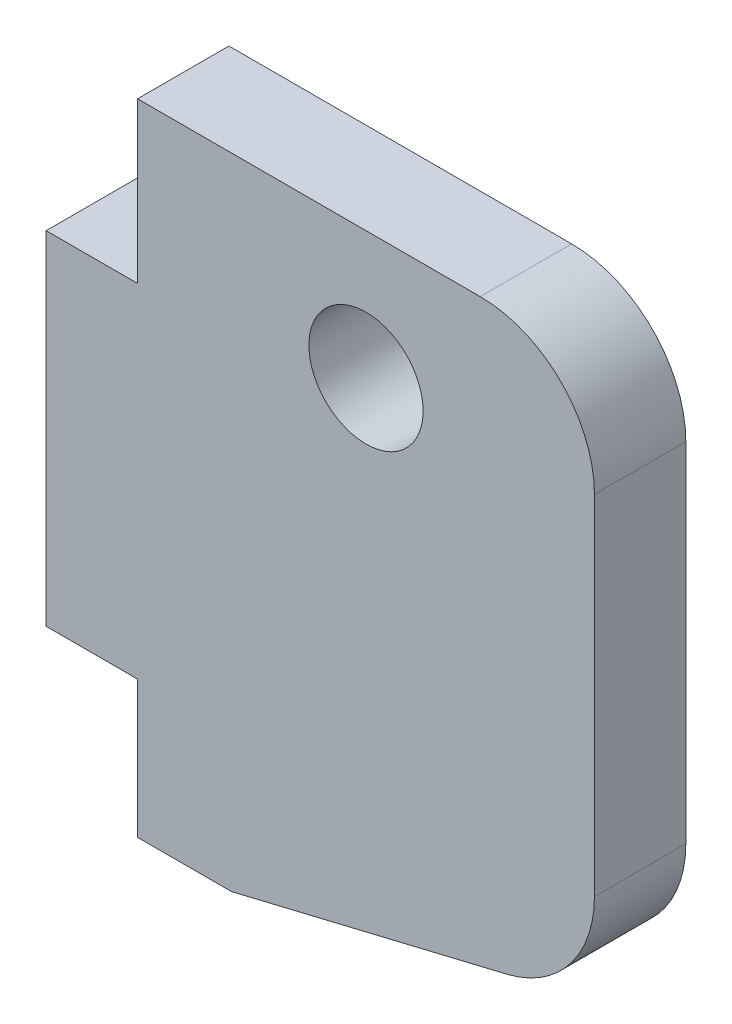
ISO-10303-21;
HEADER;
FILE_DESCRIPTION(('STEP AP214'),'2;1');
FILE_NAME('part.step','',(''),(''),'','','');
FILE_SCHEMA(('AUTOMOTIVE_DESIGN { 1 0 10303 214 1 1 1 1 }'));
ENDSEC;
DATA;
#1=APPLICATION_CONTEXT('core data for automotive mechanical design processes');
#2=APPLICATION_PROTOCOL_DEFINITION('international standard','automotive_design',2000,#1);
#3=PRODUCT_CONTEXT('',#1,'mechanical');
#4=PRODUCT('Part','Part','',(#3));
#5=PRODUCT_RELATED_PRODUCT_CATEGORY('part','',(#4));
#6=PRODUCT_DEFINITION_FORMATION('','',#4);
#7=PRODUCT_DEFINITION_CONTEXT('part definition',#1,'design');
#8=PRODUCT_DEFINITION('design','',#6,#7);
#9=PRODUCT_DEFINITION_SHAPE('','',#8);
#10=(LENGTH_UNIT() NAMED_UNIT(*) SI_UNIT(.MILLI.,.METRE.));
#11=(NAMED_UNIT(*) PLANE_ANGLE_UNIT() SI_UNIT($,.RADIAN.));
#12=(NAMED_UNIT(*) SI_UNIT($,.STERADIAN.) SOLID_ANGLE_UNIT());
#13=UNCERTAINTY_MEASURE_WITH_UNIT(LENGTH_MEASURE(1.E-05),#10,'distance_accuracy_value','');
#14=(GEOMETRIC_REPRESENTATION_CONTEXT(3) GLOBAL_UNCERTAINTY_ASSIGNED_CONTEXT((#13)) GLOBAL_UNIT_ASSIGNED_CONTEXT((#10,
#11,#12)) REPRESENTATION_CONTEXT('',''));
#15=CARTESIAN_POINT('',(0.,0.,0.));
#16=DIRECTION('',(0.,0.,1.));
#17=DIRECTION('',(1.,0.,0.));
#18=AXIS2_PLACEMENT_3D('',#15,#16,#17);
#19=CARTESIAN_POINT('',(0.,-6.,4.));
#20=DIRECTION('',(0.,-1.,0.));
#21=DIRECTION('',(1.,0.,0.));
#22=AXIS2_PLACEMENT_3D('',#19,#20,#21);
#23=PLANE('',#22);
#24=DIRECTION('',(-1.,0.,0.));
#25=VECTOR('',#24,1.);
#26=CARTESIAN_POINT('',(0.,-6.,0.));
#27=LINE('',#26,#25);
#28=CARTESIAN_POINT('',(8.11076380065098,-6.,0.));
#29=VERTEX_POINT('',#28);
#30=CARTESIAN_POINT('',(4.,-6.,0.));
#31=VERTEX_POINT('',#30);
#32=EDGE_CURVE('E134',#29,#31,#27,.T.);
#33=ORIENTED_EDGE('',*,*,#32,.F.);
#34=DIRECTION('',(0.,0.,-1.));
#35=VECTOR('',#34,1.);
#36=CARTESIAN_POINT('',(8.11076380065098,-6.,4.));
#37=LINE('',#36,#35);
#38=CARTESIAN_POINT('',(8.11076380065098,-6.,4.));
#39=VERTEX_POINT('',#38);
#40=EDGE_CURVE('E129',#39,#29,#37,.T.);
#41=ORIENTED_EDGE('',*,*,#40,.F.);
#42=DIRECTION('',(-1.,0.,0.));
#43=VECTOR('',#42,1.);
#44=CARTESIAN_POINT('',(0.,-6.,4.));
#45=LINE('',#44,#43);
#46=CARTESIAN_POINT('',(4.,-6.,4.));
#47=VERTEX_POINT('',#46);
#48=EDGE_CURVE('E131',#39,#47,#45,.T.);
#49=ORIENTED_EDGE('',*,*,#48,.T.);
#50=DIRECTION('',(0.,0.,-1.));
#51=VECTOR('',#50,1.);
#52=CARTESIAN_POINT('',(4.,-6.,4.));
#53=LINE('',#52,#51);
#54=EDGE_CURVE('E182',#47,#31,#53,.T.);
#55=ORIENTED_EDGE('',*,*,#54,.T.);
#56=EDGE_LOOP('',(#33,#41,#49,#55));
#57=FACE_BOUND('',#56,.T.);
#58=ADVANCED_FACE('F41',(#57),#23,.T.);
#59=CARTESIAN_POINT('',(1.80511260454205,-7.51468830086219,4.));
#60=DIRECTION('',(-0.233567159699266,0.972340671734973,0.));
#61=DIRECTION('',(-0.972340671734973,-0.233567159699266,0.));
#62=AXIS2_PLACEMENT_3D('',#59,#60,#61);
#63=PLANE('',#62);
#64=DIRECTION('',(0.972340671734973,0.233567159699266,0.));
#65=VECTOR('',#64,1.);
#66=CARTESIAN_POINT('',(1.80511260454205,-7.51468830086219,0.));
#67=LINE('',#66,#65);
#68=CARTESIAN_POINT('',(20.1678357984963,-3.10375576925998,0.));
#69=VERTEX_POINT('',#68);
#70=EDGE_CURVE('E189',#29,#69,#67,.T.);
#71=ORIENTED_EDGE('',*,*,#70,.T.);
#72=DIRECTION('',(0.,0.,-1.));
#73=VECTOR('',#72,1.);
#74=CARTESIAN_POINT('',(20.1678357984963,-3.10375576925998,4.));
#75=LINE('',#74,#73);
#76=CARTESIAN_POINT('',(20.1678357984963,-3.10375576925998,4.));
#77=VERTEX_POINT('',#76);
#78=EDGE_CURVE('E65',#69,#77,#75,.F.);
#79=ORIENTED_EDGE('',*,*,#78,.T.);
#80=DIRECTION('',(0.972340671734973,0.233567159699266,0.));
#81=VECTOR('',#80,1.);
#82=CARTESIAN_POINT('',(1.80511260454205,-7.51468830086219,4.));
#83=LINE('',#82,#81);
#84=EDGE_CURVE('E140',#39,#77,#83,.T.);
#85=ORIENTED_EDGE('',*,*,#84,.F.);
#86=ORIENTED_EDGE('',*,*,#40,.T.);
#87=EDGE_LOOP('',(#71,#79,#85,#86));
#88=FACE_BOUND('',#87,.T.);
#89=ADVANCED_FACE('F141',(#88),#63,.F.);
#90=CARTESIAN_POINT('',(24.,0.,4.));
#91=DIRECTION('',(1.,0.,0.));
#92=DIRECTION('',(0.,1.,0.));
#93=AXIS2_PLACEMENT_3D('',#90,#91,#92);
#94=PLANE('',#93);
#95=DIRECTION('',(0.,-1.,0.));
#96=VECTOR('',#95,1.);
#97=CARTESIAN_POINT('',(24.,0.,4.));
#98=LINE('',#97,#96);
#99=CARTESIAN_POINT('',(24.,17.,4.));
#100=VERTEX_POINT('',#99);
#101=CARTESIAN_POINT('',(24.,1.75794758941488,4.));
#102=VERTEX_POINT('',#101);
#103=EDGE_CURVE('E144',#100,#102,#98,.T.);
#104=ORIENTED_EDGE('',*,*,#103,.T.);
#105=DIRECTION('',(0.,0.,-1.));
#106=VECTOR('',#105,1.);
#107=CARTESIAN_POINT('',(24.,1.75794758941488,0.));
#108=LINE('',#107,#106);
#109=CARTESIAN_POINT('',(24.,1.75794758941488,0.));
#110=VERTEX_POINT('',#109);
#111=EDGE_CURVE('E237',#102,#110,#108,.T.);
#112=ORIENTED_EDGE('',*,*,#111,.T.);
#113=DIRECTION('',(0.,-1.,0.));
#114=VECTOR('',#113,1.);
#115=CARTESIAN_POINT('',(24.,0.,0.));
#116=LINE('',#115,#114);
#117=CARTESIAN_POINT('',(24.,17.,0.));
#118=VERTEX_POINT('',#117);
#119=EDGE_CURVE('E192',#118,#110,#116,.T.);
#120=ORIENTED_EDGE('',*,*,#119,.F.);
#121=DIRECTION('',(0.,0.,-1.));
#122=VECTOR('',#121,1.);
#123=CARTESIAN_POINT('',(24.,17.,4.));
#124=LINE('',#123,#122);
#125=EDGE_CURVE('E137',#118,#100,#124,.F.);
#126=ORIENTED_EDGE('',*,*,#125,.T.);
#127=EDGE_LOOP('',(#104,#112,#120,#126));
#128=FACE_BOUND('',#127,.T.);
#129=ADVANCED_FACE('F254',(#128),#94,.T.);
#130=CARTESIAN_POINT('',(0.,22.,4.));
#131=DIRECTION('',(0.,1.,0.));
#132=DIRECTION('',(-1.,0.,0.));
#133=AXIS2_PLACEMENT_3D('',#130,#131,#132);
#134=PLANE('',#133);
#135=DIRECTION('',(1.,0.,0.));
#136=VECTOR('',#135,1.);
#137=CARTESIAN_POINT('',(0.,22.,4.));
#138=LINE('',#137,#136);
#139=CARTESIAN_POINT('',(4.,22.,4.));
#140=VERTEX_POINT('',#139);
#141=CARTESIAN_POINT('',(19.,22.,4.));
#142=VERTEX_POINT('',#141);
#143=EDGE_CURVE('E161',#140,#142,#138,.T.);
#144=ORIENTED_EDGE('',*,*,#143,.T.);
#145=DIRECTION('',(0.,0.,-1.));
#146=VECTOR('',#145,1.);
#147=CARTESIAN_POINT('',(19.,22.,4.));
#148=LINE('',#147,#146);
#149=CARTESIAN_POINT('',(19.,22.,0.));
#150=VERTEX_POINT('',#149);
#151=EDGE_CURVE('E11',#142,#150,#148,.T.);
#152=ORIENTED_EDGE('',*,*,#151,.T.);
#153=DIRECTION('',(1.,0.,0.));
#154=VECTOR('',#153,1.);
#155=CARTESIAN_POINT('',(0.,22.,0.));
#156=LINE('',#155,#154);
#157=CARTESIAN_POINT('',(4.,22.,0.));
#158=VERTEX_POINT('',#157);
#159=EDGE_CURVE('E196',#158,#150,#156,.T.);
#160=ORIENTED_EDGE('',*,*,#159,.F.);
#161=DIRECTION('',(0.,0.,-1.));
#162=VECTOR('',#161,1.);
#163=CARTESIAN_POINT('',(4.,22.,4.));
#164=LINE('',#163,#162);
#165=EDGE_CURVE('E138',#140,#158,#164,.T.);
#166=ORIENTED_EDGE('',*,*,#165,.F.);
#167=EDGE_LOOP('',(#144,#152,#160,#166));
#168=FACE_BOUND('',#167,.T.);
#169=ADVANCED_FACE('F264',(#168),#134,.T.);
#170=CARTESIAN_POINT('',(4.,0.,4.));
#171=DIRECTION('',(-1.,0.,0.));
#172=DIRECTION('',(0.,0.,1.));
#173=AXIS2_PLACEMENT_3D('',#170,#171,#172);
#174=PLANE('',#173);
#175=DIRECTION('',(0.,1.,0.));
#176=VECTOR('',#175,1.);
#177=CARTESIAN_POINT('',(4.,0.,0.));
#178=LINE('',#177,#176);
#179=CARTESIAN_POINT('',(4.,15.,0.));
#180=VERTEX_POINT('',#179);
#181=EDGE_CURVE('E200',#180,#158,#178,.T.);
#182=ORIENTED_EDGE('',*,*,#181,.F.);
#183=DIRECTION('',(0.,0.,-1.));
#184=VECTOR('',#183,1.);
#185=CARTESIAN_POINT('',(4.,15.,4.));
#186=LINE('',#185,#184);
#187=CARTESIAN_POINT('',(4.,15.,4.));
#188=VERTEX_POINT('',#187);
#189=EDGE_CURVE('E230',#188,#180,#186,.T.);
#190=ORIENTED_EDGE('',*,*,#189,.F.);
#191=DIRECTION('',(0.,1.,0.));
#192=VECTOR('',#191,1.);
#193=CARTESIAN_POINT('',(4.,0.,4.));
#194=LINE('',#193,#192);
#195=EDGE_CURVE('E164',#188,#140,#194,.T.);
#196=ORIENTED_EDGE('',*,*,#195,.T.);
#197=ORIENTED_EDGE('',*,*,#165,.T.);
#198=EDGE_LOOP('',(#182,#190,#196,#197));
#199=FACE_BOUND('',#198,.T.);
#200=ADVANCED_FACE('F268',(#199),#174,.T.);
#201=CARTESIAN_POINT('',(0.,15.,4.));
#202=DIRECTION('',(0.,1.,0.));
#203=DIRECTION('',(0.,0.,1.));
#204=AXIS2_PLACEMENT_3D('',#201,#202,#203);
#205=PLANE('',#204);
#206=DIRECTION('',(1.,0.,0.));
#207=VECTOR('',#206,1.);
#208=CARTESIAN_POINT('',(0.,15.,0.));
#209=LINE('',#208,#207);
#210=CARTESIAN_POINT('',(0.,15.,0.));
#211=VERTEX_POINT('',#210);
#212=EDGE_CURVE('E204',#211,#180,#209,.T.);
#213=ORIENTED_EDGE('',*,*,#212,.F.);
#214=DIRECTION('',(0.,0.,-1.));
#215=VECTOR('',#214,1.);
#216=CARTESIAN_POINT('',(0.,15.,4.));
#217=LINE('',#216,#215);
#218=CARTESIAN_POINT('',(0.,15.,4.));
#219=VERTEX_POINT('',#218);
#220=EDGE_CURVE('E227',#219,#211,#217,.T.);
#221=ORIENTED_EDGE('',*,*,#220,.F.);
#222=DIRECTION('',(1.,0.,0.));
#223=VECTOR('',#222,1.);
#224=CARTESIAN_POINT('',(0.,15.,4.));
#225=LINE('',#224,#223);
#226=EDGE_CURVE('E168',#219,#188,#225,.T.);
#227=ORIENTED_EDGE('',*,*,#226,.T.);
#228=ORIENTED_EDGE('',*,*,#189,.T.);
#229=EDGE_LOOP('',(#213,#221,#227,#228));
#230=FACE_BOUND('',#229,.T.);
#231=ADVANCED_FACE('F273',(#230),#205,.T.);
#232=CARTESIAN_POINT('',(0.,0.,4.));
#233=DIRECTION('',(-1.,0.,0.));
#234=DIRECTION('',(0.,0.,1.));
#235=AXIS2_PLACEMENT_3D('',#232,#233,#234);
#236=PLANE('',#235);
#237=DIRECTION('',(0.,1.,0.));
#238=VECTOR('',#237,1.);
#239=CARTESIAN_POINT('',(0.,0.,0.));
#240=LINE('',#239,#238);
#241=CARTESIAN_POINT('',(0.,0.,0.));
#242=VERTEX_POINT('',#241);
#243=EDGE_CURVE('E208',#242,#211,#240,.T.);
#244=ORIENTED_EDGE('',*,*,#243,.F.);
#245=DIRECTION('',(0.,0.,-1.));
#246=VECTOR('',#245,1.);
#247=CARTESIAN_POINT('',(0.,0.,4.));
#248=LINE('',#247,#246);
#249=CARTESIAN_POINT('',(0.,0.,4.));
#250=VERTEX_POINT('',#249);
#251=EDGE_CURVE('E224',#250,#242,#248,.T.);
#252=ORIENTED_EDGE('',*,*,#251,.F.);
#253=DIRECTION('',(0.,1.,0.));
#254=VECTOR('',#253,1.);
#255=CARTESIAN_POINT('',(0.,0.,4.));
#256=LINE('',#255,#254);
#257=EDGE_CURVE('E172',#250,#219,#256,.T.);
#258=ORIENTED_EDGE('',*,*,#257,.T.);
#259=ORIENTED_EDGE('',*,*,#220,.T.);
#260=EDGE_LOOP('',(#244,#252,#258,#259));
#261=FACE_BOUND('',#260,.T.);
#262=ADVANCED_FACE('F276',(#261),#236,.T.);
#263=CARTESIAN_POINT('',(0.,0.,4.));
#264=DIRECTION('',(0.,-1.,0.));
#265=DIRECTION('',(1.,0.,0.));
#266=AXIS2_PLACEMENT_3D('',#263,#264,#265);
#267=PLANE('',#266);
#268=DIRECTION('',(-1.,0.,0.));
#269=VECTOR('',#268,1.);
#270=CARTESIAN_POINT('',(0.,0.,0.));
#271=LINE('',#270,#269);
#272=CARTESIAN_POINT('',(4.,0.,0.));
#273=VERTEX_POINT('',#272);
#274=EDGE_CURVE('E212',#273,#242,#271,.T.);
#275=ORIENTED_EDGE('',*,*,#274,.F.);
#276=DIRECTION('',(0.,0.,-1.));
#277=VECTOR('',#276,1.);
#278=CARTESIAN_POINT('',(4.,0.,4.));
#279=LINE('',#278,#277);
#280=CARTESIAN_POINT('',(4.,0.,4.));
#281=VERTEX_POINT('',#280);
#282=EDGE_CURVE('E221',#281,#273,#279,.T.);
#283=ORIENTED_EDGE('',*,*,#282,.F.);
#284=DIRECTION('',(-1.,0.,0.));
#285=VECTOR('',#284,1.);
#286=CARTESIAN_POINT('',(0.,0.,4.));
#287=LINE('',#286,#285);
#288=EDGE_CURVE('E176',#281,#250,#287,.T.);
#289=ORIENTED_EDGE('',*,*,#288,.T.);
#290=ORIENTED_EDGE('',*,*,#251,.T.);
#291=EDGE_LOOP('',(#275,#283,#289,#290));
#292=FACE_BOUND('',#291,.T.);
#293=ADVANCED_FACE('F279',(#292),#267,.T.);
#294=CARTESIAN_POINT('',(14.,16.41,4.));
#295=DIRECTION('',(0.,0.,-1.));
#296=DIRECTION('',(-1.,0.,0.));
#297=AXIS2_PLACEMENT_3D('',#294,#295,#296);
#298=CYLINDRICAL_SURFACE('',#297,2.5);
#299=CARTESIAN_POINT('',(14.,16.41,4.));
#300=DIRECTION('',(0.,0.,1.));
#301=DIRECTION('',(1.,0.,0.));
#302=AXIS2_PLACEMENT_3D('',#299,#300,#301);
#303=CIRCLE('',#302,2.5);
#304=CARTESIAN_POINT('',(16.5,16.41,4.));
#305=VERTEX_POINT('',#304);
#306=EDGE_CURVE('E151',#305,#305,#303,.T.);
#307=ORIENTED_EDGE('',*,*,#306,.T.);
#308=EDGE_LOOP('',(#307));
#309=FACE_BOUND('',#308,.T.);
#310=CARTESIAN_POINT('',(14.,16.41,0.));
#311=DIRECTION('',(0.,0.,1.));
#312=DIRECTION('',(1.,0.,0.));
#313=AXIS2_PLACEMENT_3D('',#310,#311,#312);
#314=CIRCLE('',#313,2.5);
#315=CARTESIAN_POINT('',(16.5,16.41,0.));
#316=VERTEX_POINT('',#315);
#317=EDGE_CURVE('E183',#316,#316,#314,.T.);
#318=ORIENTED_EDGE('',*,*,#317,.F.);
#319=EDGE_LOOP('',(#318));
#320=FACE_BOUND('',#319,.T.);
#321=ADVANCED_FACE('F284',(#309,#320),#298,.F.);
#322=CARTESIAN_POINT('',(4.,0.,4.));
#323=DIRECTION('',(-1.,0.,0.));
#324=DIRECTION('',(0.,0.,1.));
#325=AXIS2_PLACEMENT_3D('',#322,#323,#324);
#326=PLANE('',#325);
#327=DIRECTION('',(0.,1.,0.));
#328=VECTOR('',#327,1.);
#329=CARTESIAN_POINT('',(4.,0.,0.));
#330=LINE('',#329,#328);
#331=EDGE_CURVE('E155',#31,#273,#330,.T.);
#332=ORIENTED_EDGE('',*,*,#331,.F.);
#333=ORIENTED_EDGE('',*,*,#54,.F.);
#334=DIRECTION('',(0.,1.,0.));
#335=VECTOR('',#334,1.);
#336=CARTESIAN_POINT('',(4.,0.,4.));
#337=LINE('',#336,#335);
#338=EDGE_CURVE('E149',#47,#281,#337,.T.);
#339=ORIENTED_EDGE('',*,*,#338,.T.);
#340=ORIENTED_EDGE('',*,*,#282,.T.);
#341=EDGE_LOOP('',(#332,#333,#339,#340));
#342=FACE_BOUND('',#341,.T.);
#343=ADVANCED_FACE('F282',(#342),#326,.T.);
#344=CARTESIAN_POINT('',(0.,0.,4.));
#345=DIRECTION('',(0.,0.,1.));
#346=DIRECTION('',(1.,0.,0.));
#347=AXIS2_PLACEMENT_3D('',#344,#345,#346);
#348=PLANE('',#347);
#349=ORIENTED_EDGE('',*,*,#306,.F.);
#350=EDGE_LOOP('',(#349));
#351=FACE_BOUND('',#350,.T.);
#352=ORIENTED_EDGE('',*,*,#84,.T.);
#353=CARTESIAN_POINT('',(19.,1.75794758941488,4.));
#354=DIRECTION('',(0.,0.,1.));
#355=DIRECTION('',(1.,0.,0.));
#356=AXIS2_PLACEMENT_3D('',#353,#354,#355);
#357=CIRCLE('',#356,5.);
#358=EDGE_CURVE('E50',#77,#102,#357,.T.);
#359=ORIENTED_EDGE('',*,*,#358,.T.);
#360=ORIENTED_EDGE('',*,*,#103,.F.);
#361=CARTESIAN_POINT('',(19.,17.,4.));
#362=DIRECTION('',(0.,0.,1.));
#363=DIRECTION('',(1.,0.,0.));
#364=AXIS2_PLACEMENT_3D('',#361,#362,#363);
#365=CIRCLE('',#364,5.);
#366=EDGE_CURVE('E57',#100,#142,#365,.T.);
#367=ORIENTED_EDGE('',*,*,#366,.T.);
#368=ORIENTED_EDGE('',*,*,#143,.F.);
#369=ORIENTED_EDGE('',*,*,#195,.F.);
#370=ORIENTED_EDGE('',*,*,#226,.F.);
#371=ORIENTED_EDGE('',*,*,#257,.F.);
#372=ORIENTED_EDGE('',*,*,#288,.F.);
#373=ORIENTED_EDGE('',*,*,#338,.F.);
#374=ORIENTED_EDGE('',*,*,#48,.F.);
#375=EDGE_LOOP('',(#352,#359,#360,#367,#368,#369,#370,#371,#372,#373,#374));
#376=FACE_BOUND('',#375,.T.);
#377=ADVANCED_FACE('F146',(#351,#376),#348,.T.);
#378=CARTESIAN_POINT('',(0.,0.,0.));
#379=DIRECTION('',(0.,0.,1.));
#380=DIRECTION('',(1.,0.,0.));
#381=AXIS2_PLACEMENT_3D('',#378,#379,#380);
#382=PLANE('',#381);
#383=ORIENTED_EDGE('',*,*,#317,.T.);
#384=EDGE_LOOP('',(#383));
#385=FACE_BOUND('',#384,.T.);
#386=ORIENTED_EDGE('',*,*,#119,.T.);
#387=CARTESIAN_POINT('',(19.,1.75794758941488,0.));
#388=DIRECTION('',(0.,0.,1.));
#389=DIRECTION('',(1.,0.,0.));
#390=AXIS2_PLACEMENT_3D('',#387,#388,#389);
#391=CIRCLE('',#390,5.);
#392=EDGE_CURVE('E244',#110,#69,#391,.F.);
#393=ORIENTED_EDGE('',*,*,#392,.T.);
#394=ORIENTED_EDGE('',*,*,#70,.F.);
#395=ORIENTED_EDGE('',*,*,#32,.T.);
#396=ORIENTED_EDGE('',*,*,#331,.T.);
#397=ORIENTED_EDGE('',*,*,#274,.T.);
#398=ORIENTED_EDGE('',*,*,#243,.T.);
#399=ORIENTED_EDGE('',*,*,#212,.T.);
#400=ORIENTED_EDGE('',*,*,#181,.T.);
#401=ORIENTED_EDGE('',*,*,#159,.T.);
#402=CARTESIAN_POINT('',(19.,17.,0.));
#403=DIRECTION('',(0.,0.,1.));
#404=DIRECTION('',(1.,0.,0.));
#405=AXIS2_PLACEMENT_3D('',#402,#403,#404);
#406=CIRCLE('',#405,5.);
#407=EDGE_CURVE('E241',#150,#118,#406,.F.);
#408=ORIENTED_EDGE('',*,*,#407,.T.);
#409=EDGE_LOOP('',(#386,#393,#394,#395,#396,#397,#398,#399,#400,#401,#408));
#410=FACE_BOUND('',#409,.T.);
#411=ADVANCED_FACE('F259',(#385,#410),#382,.F.);
#412=CARTESIAN_POINT('',(19.,1.75794758941488,4.));
#413=DIRECTION('',(0.,0.,1.));
#414=DIRECTION('',(1.,0.,0.));
#415=AXIS2_PLACEMENT_3D('',#412,#413,#414);
#416=CYLINDRICAL_SURFACE('',#415,5.);
#417=ORIENTED_EDGE('',*,*,#358,.F.);
#418=ORIENTED_EDGE('',*,*,#78,.F.);
#419=ORIENTED_EDGE('',*,*,#392,.F.);
#420=ORIENTED_EDGE('',*,*,#111,.F.);
#421=EDGE_LOOP('',(#417,#418,#419,#420));
#422=FACE_BOUND('',#421,.T.);
#423=ADVANCED_FACE('F257',(#422),#416,.T.);
#424=CARTESIAN_POINT('',(19.,17.,4.));
#425=DIRECTION('',(0.,0.,-1.));
#426=DIRECTION('',(-1.,0.,0.));
#427=AXIS2_PLACEMENT_3D('',#424,#425,#426);
#428=CYLINDRICAL_SURFACE('',#427,5.);
#429=ORIENTED_EDGE('',*,*,#366,.F.);
#430=ORIENTED_EDGE('',*,*,#125,.F.);
#431=ORIENTED_EDGE('',*,*,#407,.F.);
#432=ORIENTED_EDGE('',*,*,#151,.F.);
#433=EDGE_LOOP('',(#429,#430,#431,#432));
#434=FACE_BOUND('',#433,.T.);
#435=ADVANCED_FACE('F43',(#434),#428,.T.);
#436=CLOSED_SHELL('',(#58,#89,#129,#169,#200,#231,#262,#293,#321,#343,#377,#411,#423,#435));
#437=MANIFOLD_SOLID_BREP('B2',#436);
#438=ADVANCED_BREP_SHAPE_REPRESENTATION('',(#18,#437),#14);
#439=SHAPE_DEFINITION_REPRESENTATION(#9,#438);
ENDSEC;
END-ISO-10303-21;
